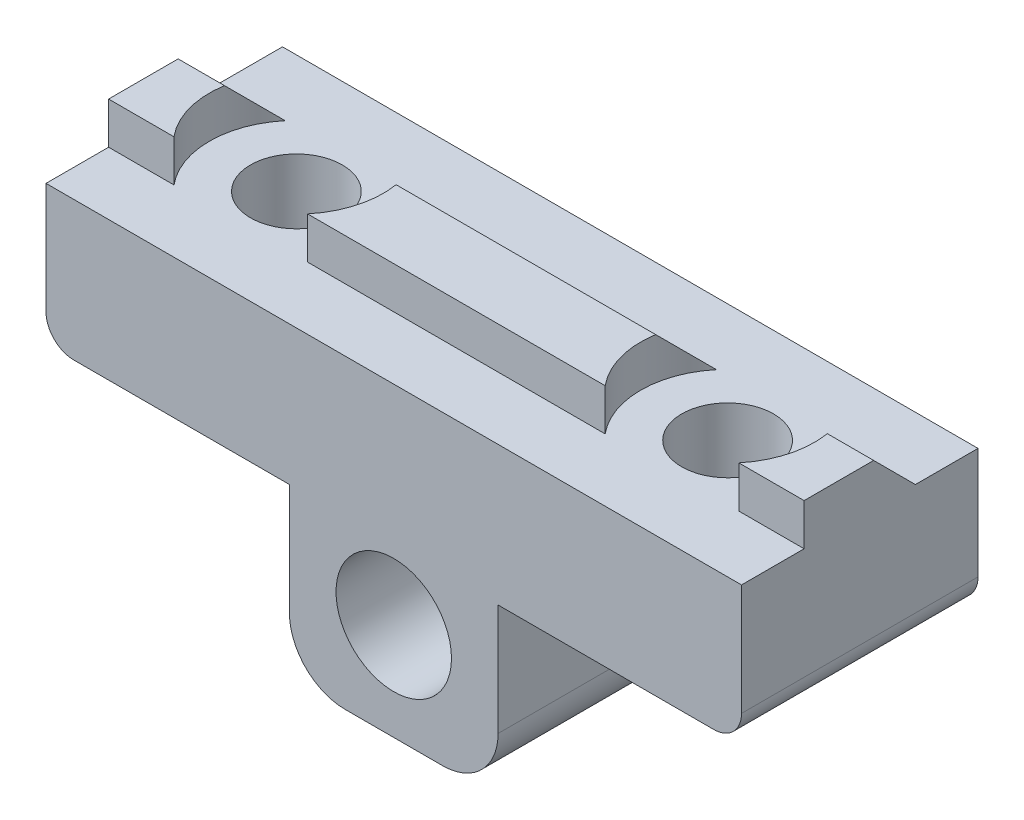
ISO-10303-21;
HEADER;
FILE_DESCRIPTION(('STEP AP214'),'2;1');
FILE_NAME('part.step','',(''),(''),'','','');
FILE_SCHEMA(('AUTOMOTIVE_DESIGN { 1 0 10303 214 1 1 1 1 }'));
ENDSEC;
DATA;
#1=APPLICATION_CONTEXT('core data for automotive mechanical design processes');
#2=APPLICATION_PROTOCOL_DEFINITION('international standard','automotive_design',2000,#1);
#3=PRODUCT_CONTEXT('',#1,'mechanical');
#4=PRODUCT('Part','Part','',(#3));
#5=PRODUCT_RELATED_PRODUCT_CATEGORY('part','',(#4));
#6=PRODUCT_DEFINITION_FORMATION('','',#4);
#7=PRODUCT_DEFINITION_CONTEXT('part definition',#1,'design');
#8=PRODUCT_DEFINITION('design','',#6,#7);
#9=PRODUCT_DEFINITION_SHAPE('','',#8);
#10=(LENGTH_UNIT() NAMED_UNIT(*) SI_UNIT(.MILLI.,.METRE.));
#11=(NAMED_UNIT(*) PLANE_ANGLE_UNIT() SI_UNIT($,.RADIAN.));
#12=(NAMED_UNIT(*) SI_UNIT($,.STERADIAN.) SOLID_ANGLE_UNIT());
#13=UNCERTAINTY_MEASURE_WITH_UNIT(LENGTH_MEASURE(1.E-05),#10,'distance_accuracy_value','');
#14=(GEOMETRIC_REPRESENTATION_CONTEXT(3) GLOBAL_UNCERTAINTY_ASSIGNED_CONTEXT((#13)) GLOBAL_UNIT_ASSIGNED_CONTEXT((#10,
#11,#12)) REPRESENTATION_CONTEXT('',''));
#15=CARTESIAN_POINT('',(0.,0.,0.));
#16=DIRECTION('',(0.,0.,1.));
#17=DIRECTION('',(1.,0.,0.));
#18=AXIS2_PLACEMENT_3D('',#15,#16,#17);
#19=CARTESIAN_POINT('',(0.,0.,17.));
#20=DIRECTION('',(0.,-1.,0.));
#21=DIRECTION('',(0.,0.,-1.));
#22=AXIS2_PLACEMENT_3D('',#19,#20,#21);
#23=PLANE('',#22);
#24=CARTESIAN_POINT('',(40.5,0.,8.5));
#25=DIRECTION('',(0.,-1.,0.));
#26=DIRECTION('',(0.,0.,-1.));
#27=AXIS2_PLACEMENT_3D('',#24,#25,#26);
#28=CIRCLE('',#27,3.3);
#29=CARTESIAN_POINT('',(40.5,0.,5.2));
#30=VERTEX_POINT('',#29);
#31=EDGE_CURVE('E294',#30,#30,#28,.T.);
#32=ORIENTED_EDGE('',*,*,#31,.T.);
#33=EDGE_LOOP('',(#32));
#34=FACE_BOUND('',#33,.T.);
#35=CARTESIAN_POINT('',(9.5,0.,8.5));
#36=DIRECTION('',(0.,-1.,0.));
#37=DIRECTION('',(0.,0.,-1.));
#38=AXIS2_PLACEMENT_3D('',#35,#36,#37);
#39=CIRCLE('',#38,3.3);
#40=CARTESIAN_POINT('',(9.5,0.,5.2));
#41=VERTEX_POINT('',#40);
#42=EDGE_CURVE('E282',#41,#41,#39,.T.);
#43=ORIENTED_EDGE('',*,*,#42,.T.);
#44=EDGE_LOOP('',(#43));
#45=FACE_BOUND('',#44,.T.);
#46=DIRECTION('',(-1.,0.,0.));
#47=VECTOR('',#46,1.);
#48=CARTESIAN_POINT('',(0.,0.,4.5));
#49=LINE('',#48,#47);
#50=CARTESIAN_POINT('',(35.6976568219254,0.,4.5));
#51=VERTEX_POINT('',#50);
#52=CARTESIAN_POINT('',(14.3023431780746,0.,4.5));
#53=VERTEX_POINT('',#52);
#54=EDGE_CURVE('E262',#51,#53,#49,.T.);
#55=ORIENTED_EDGE('',*,*,#54,.F.);
#56=CARTESIAN_POINT('',(40.5,0.,8.5));
#57=DIRECTION('',(0.,1.,0.));
#58=DIRECTION('',(0.,0.,1.));
#59=AXIS2_PLACEMENT_3D('',#56,#57,#58);
#60=CIRCLE('',#59,6.25000000000001);
#61=CARTESIAN_POINT('',(35.6976568219254,0.,12.5));
#62=VERTEX_POINT('',#61);
#63=EDGE_CURVE('E249',#51,#62,#60,.T.);
#64=ORIENTED_EDGE('',*,*,#63,.T.);
#65=DIRECTION('',(-1.,0.,0.));
#66=VECTOR('',#65,1.);
#67=CARTESIAN_POINT('',(0.,0.,12.5));
#68=LINE('',#67,#66);
#69=CARTESIAN_POINT('',(14.3023431780746,0.,12.5));
#70=VERTEX_POINT('',#69);
#71=EDGE_CURVE('E253',#62,#70,#68,.T.);
#72=ORIENTED_EDGE('',*,*,#71,.T.);
#73=CARTESIAN_POINT('',(9.5,0.,8.5));
#74=DIRECTION('',(0.,1.,0.));
#75=DIRECTION('',(0.,0.,1.));
#76=AXIS2_PLACEMENT_3D('',#73,#74,#75);
#77=CIRCLE('',#76,6.24999999999999);
#78=EDGE_CURVE('E264',#70,#53,#77,.T.);
#79=ORIENTED_EDGE('',*,*,#78,.T.);
#80=EDGE_LOOP('',(#55,#64,#72,#79));
#81=FACE_BOUND('',#80,.T.);
#82=DIRECTION('',(0.,0.,-1.));
#83=VECTOR('',#82,1.);
#84=CARTESIAN_POINT('',(50.,0.,17.));
#85=LINE('',#84,#83);
#86=CARTESIAN_POINT('',(50.,0.,17.));
#87=VERTEX_POINT('',#86);
#88=CARTESIAN_POINT('',(50.,0.,12.5));
#89=VERTEX_POINT('',#88);
#90=EDGE_CURVE('E362',#87,#89,#85,.T.);
#91=ORIENTED_EDGE('',*,*,#90,.T.);
#92=DIRECTION('',(-1.,0.,0.));
#93=VECTOR('',#92,1.);
#94=CARTESIAN_POINT('',(0.,0.,12.5));
#95=LINE('',#94,#93);
#96=CARTESIAN_POINT('',(45.3023431780747,0.,12.5));
#97=VERTEX_POINT('',#96);
#98=EDGE_CURVE('E225',#89,#97,#95,.T.);
#99=ORIENTED_EDGE('',*,*,#98,.T.);
#100=CARTESIAN_POINT('',(40.5,0.,8.5));
#101=DIRECTION('',(0.,1.,0.));
#102=DIRECTION('',(0.,0.,1.));
#103=AXIS2_PLACEMENT_3D('',#100,#101,#102);
#104=CIRCLE('',#103,6.25000000000001);
#105=CARTESIAN_POINT('',(45.3023431780747,0.,4.5));
#106=VERTEX_POINT('',#105);
#107=EDGE_CURVE('E200',#97,#106,#104,.T.);
#108=ORIENTED_EDGE('',*,*,#107,.T.);
#109=DIRECTION('',(-1.,0.,0.));
#110=VECTOR('',#109,1.);
#111=CARTESIAN_POINT('',(0.,0.,4.5));
#112=LINE('',#111,#110);
#113=CARTESIAN_POINT('',(50.,0.,4.5));
#114=VERTEX_POINT('',#113);
#115=EDGE_CURVE('E215',#114,#106,#112,.T.);
#116=ORIENTED_EDGE('',*,*,#115,.F.);
#117=CARTESIAN_POINT('',(50.,0.,0.));
#118=VERTEX_POINT('',#117);
#119=EDGE_CURVE('E361',#114,#118,#85,.T.);
#120=ORIENTED_EDGE('',*,*,#119,.T.);
#121=DIRECTION('',(-1.,0.,0.));
#122=VECTOR('',#121,1.);
#123=CARTESIAN_POINT('',(0.,0.,0.));
#124=LINE('',#123,#122);
#125=CARTESIAN_POINT('',(0.,0.,0.));
#126=VERTEX_POINT('',#125);
#127=EDGE_CURVE('E314',#118,#126,#124,.T.);
#128=ORIENTED_EDGE('',*,*,#127,.T.);
#129=DIRECTION('',(0.,0.,-1.));
#130=VECTOR('',#129,1.);
#131=CARTESIAN_POINT('',(0.,0.,17.));
#132=LINE('',#131,#130);
#133=CARTESIAN_POINT('',(0.,0.,4.5));
#134=VERTEX_POINT('',#133);
#135=EDGE_CURVE('E334',#134,#126,#132,.T.);
#136=ORIENTED_EDGE('',*,*,#135,.F.);
#137=DIRECTION('',(-1.,0.,0.));
#138=VECTOR('',#137,1.);
#139=CARTESIAN_POINT('',(0.,0.,4.5));
#140=LINE('',#139,#138);
#141=CARTESIAN_POINT('',(4.69765682192537,0.,4.5));
#142=VERTEX_POINT('',#141);
#143=EDGE_CURVE('E241',#142,#134,#140,.T.);
#144=ORIENTED_EDGE('',*,*,#143,.F.);
#145=CARTESIAN_POINT('',(9.5,0.,8.5));
#146=DIRECTION('',(0.,1.,0.));
#147=DIRECTION('',(0.,0.,1.));
#148=AXIS2_PLACEMENT_3D('',#145,#146,#147);
#149=CIRCLE('',#148,6.24999999999999);
#150=CARTESIAN_POINT('',(4.69765682192537,0.,12.5));
#151=VERTEX_POINT('',#150);
#152=EDGE_CURVE('E204',#142,#151,#149,.T.);
#153=ORIENTED_EDGE('',*,*,#152,.T.);
#154=DIRECTION('',(-1.,0.,0.));
#155=VECTOR('',#154,1.);
#156=CARTESIAN_POINT('',(0.,0.,12.5));
#157=LINE('',#156,#155);
#158=CARTESIAN_POINT('',(0.,0.,12.5));
#159=VERTEX_POINT('',#158);
#160=EDGE_CURVE('E233',#151,#159,#157,.T.);
#161=ORIENTED_EDGE('',*,*,#160,.T.);
#162=CARTESIAN_POINT('',(0.,0.,17.));
#163=VERTEX_POINT('',#162);
#164=EDGE_CURVE('E358',#163,#159,#132,.T.);
#165=ORIENTED_EDGE('',*,*,#164,.F.);
#166=DIRECTION('',(-1.,0.,0.));
#167=VECTOR('',#166,1.);
#168=CARTESIAN_POINT('',(0.,0.,17.));
#169=LINE('',#168,#167);
#170=EDGE_CURVE('E332',#87,#163,#169,.T.);
#171=ORIENTED_EDGE('',*,*,#170,.F.);
#172=EDGE_LOOP('',(#91,#99,#108,#116,#120,#128,#136,#144,#153,#161,#165,#171));
#173=FACE_BOUND('',#172,.T.);
#174=ADVANCED_FACE('F35',(#34,#45,#81,#173),#23,.F.);
#175=CARTESIAN_POINT('',(0.,-7.99999999999999,17.));
#176=DIRECTION('',(1.,0.,0.));
#177=DIRECTION('',(0.,0.,-1.));
#178=AXIS2_PLACEMENT_3D('',#175,#176,#177);
#179=PLANE('',#178);
#180=DIRECTION('',(0.,0.,1.));
#181=VECTOR('',#180,1.);
#182=CARTESIAN_POINT('',(0.,3.,0.));
#183=LINE('',#182,#181);
#184=CARTESIAN_POINT('',(0.,3.,7.5));
#185=VERTEX_POINT('',#184);
#186=CARTESIAN_POINT('',(0.,3.,12.5));
#187=VERTEX_POINT('',#186);
#188=EDGE_CURVE('E232',#185,#187,#183,.T.);
#189=ORIENTED_EDGE('',*,*,#188,.F.);
#190=DIRECTION('',(0.,-0.707106781186548,-0.707106781186547));
#191=VECTOR('',#190,1.);
#192=CARTESIAN_POINT('',(0.,3.,7.5));
#193=LINE('',#192,#191);
#194=EDGE_CURVE('E408',#185,#134,#193,.T.);
#195=ORIENTED_EDGE('',*,*,#194,.T.);
#196=ORIENTED_EDGE('',*,*,#135,.T.);
#197=DIRECTION('',(0.,-1.,0.));
#198=VECTOR('',#197,1.);
#199=CARTESIAN_POINT('',(0.,-7.99999999999999,0.));
#200=LINE('',#199,#198);
#201=CARTESIAN_POINT('',(0.,-7.99999999999999,0.));
#202=VERTEX_POINT('',#201);
#203=EDGE_CURVE('E309',#126,#202,#200,.T.);
#204=ORIENTED_EDGE('',*,*,#203,.T.);
#205=DIRECTION('',(0.,0.,-1.));
#206=VECTOR('',#205,1.);
#207=CARTESIAN_POINT('',(0.,-7.99999999999999,17.));
#208=LINE('',#207,#206);
#209=CARTESIAN_POINT('',(0.,-7.99999999999999,17.));
#210=VERTEX_POINT('',#209);
#211=EDGE_CURVE('E379',#210,#202,#208,.T.);
#212=ORIENTED_EDGE('',*,*,#211,.F.);
#213=DIRECTION('',(0.,-1.,0.));
#214=VECTOR('',#213,1.);
#215=CARTESIAN_POINT('',(0.,-7.99999999999999,17.));
#216=LINE('',#215,#214);
#217=EDGE_CURVE('E310',#163,#210,#216,.T.);
#218=ORIENTED_EDGE('',*,*,#217,.F.);
#219=ORIENTED_EDGE('',*,*,#164,.T.);
#220=DIRECTION('',(0.,-1.,0.));
#221=VECTOR('',#220,1.);
#222=CARTESIAN_POINT('',(0.,3.,12.5));
#223=LINE('',#222,#221);
#224=EDGE_CURVE('E247',#187,#159,#223,.T.);
#225=ORIENTED_EDGE('',*,*,#224,.F.);
#226=EDGE_LOOP('',(#189,#195,#196,#204,#212,#218,#219,#225));
#227=FACE_BOUND('',#226,.T.);
#228=ADVANCED_FACE('F437',(#227),#179,.F.);
#229=CARTESIAN_POINT('',(2.,-8.,17.));
#230=DIRECTION('',(0.,0.,-1.));
#231=DIRECTION('',(-1.,0.,0.));
#232=AXIS2_PLACEMENT_3D('',#229,#230,#231);
#233=CYLINDRICAL_SURFACE('',#232,2.);
#234=CARTESIAN_POINT('',(2.,-8.,0.));
#235=DIRECTION('',(0.,0.,1.));
#236=DIRECTION('',(1.,0.,0.));
#237=AXIS2_PLACEMENT_3D('',#234,#235,#236);
#238=CIRCLE('',#237,2.);
#239=CARTESIAN_POINT('',(2.00000000000001,-10.,0.));
#240=VERTEX_POINT('',#239);
#241=EDGE_CURVE('E337',#202,#240,#238,.T.);
#242=ORIENTED_EDGE('',*,*,#241,.T.);
#243=DIRECTION('',(0.,0.,-1.));
#244=VECTOR('',#243,1.);
#245=CARTESIAN_POINT('',(2.00000000000001,-10.,17.));
#246=LINE('',#245,#244);
#247=CARTESIAN_POINT('',(2.00000000000001,-10.,17.));
#248=VERTEX_POINT('',#247);
#249=EDGE_CURVE('E376',#248,#240,#246,.T.);
#250=ORIENTED_EDGE('',*,*,#249,.F.);
#251=CARTESIAN_POINT('',(2.,-8.,17.));
#252=DIRECTION('',(0.,0.,1.));
#253=DIRECTION('',(1.,0.,0.));
#254=AXIS2_PLACEMENT_3D('',#251,#252,#253);
#255=CIRCLE('',#254,2.);
#256=EDGE_CURVE('E313',#210,#248,#255,.T.);
#257=ORIENTED_EDGE('',*,*,#256,.F.);
#258=ORIENTED_EDGE('',*,*,#211,.T.);
#259=EDGE_LOOP('',(#242,#250,#257,#258));
#260=FACE_BOUND('',#259,.T.);
#261=ADVANCED_FACE('F443',(#260),#233,.T.);
#262=CARTESIAN_POINT('',(17.5,-10.,17.));
#263=DIRECTION('',(0.,1.,0.));
#264=DIRECTION('',(0.,0.,1.));
#265=AXIS2_PLACEMENT_3D('',#262,#263,#264);
#266=PLANE('',#265);
#267=CARTESIAN_POINT('',(9.5,-10.,8.5));
#268=DIRECTION('',(0.,-1.,0.));
#269=DIRECTION('',(0.,0.,-1.));
#270=AXIS2_PLACEMENT_3D('',#267,#268,#269);
#271=CIRCLE('',#270,6.);
#272=CARTESIAN_POINT('',(9.5,-10.,2.5));
#273=VERTEX_POINT('',#272);
#274=EDGE_CURVE('E273',#273,#273,#271,.T.);
#275=ORIENTED_EDGE('',*,*,#274,.F.);
#276=EDGE_LOOP('',(#275));
#277=FACE_BOUND('',#276,.T.);
#278=DIRECTION('',(1.,0.,0.));
#279=VECTOR('',#278,1.);
#280=CARTESIAN_POINT('',(17.5,-10.,0.));
#281=LINE('',#280,#279);
#282=CARTESIAN_POINT('',(17.5,-10.,0.));
#283=VERTEX_POINT('',#282);
#284=EDGE_CURVE('E339',#240,#283,#281,.T.);
#285=ORIENTED_EDGE('',*,*,#284,.T.);
#286=DIRECTION('',(0.,0.,-1.));
#287=VECTOR('',#286,1.);
#288=CARTESIAN_POINT('',(17.5,-10.,17.));
#289=LINE('',#288,#287);
#290=CARTESIAN_POINT('',(17.5,-10.,17.));
#291=VERTEX_POINT('',#290);
#292=EDGE_CURVE('E373',#291,#283,#289,.T.);
#293=ORIENTED_EDGE('',*,*,#292,.F.);
#294=DIRECTION('',(1.,0.,0.));
#295=VECTOR('',#294,1.);
#296=CARTESIAN_POINT('',(17.5,-10.,17.));
#297=LINE('',#296,#295);
#298=EDGE_CURVE('E316',#248,#291,#297,.T.);
#299=ORIENTED_EDGE('',*,*,#298,.F.);
#300=ORIENTED_EDGE('',*,*,#249,.T.);
#301=EDGE_LOOP('',(#285,#293,#299,#300));
#302=FACE_BOUND('',#301,.T.);
#303=ADVANCED_FACE('F475',(#277,#302),#266,.F.);
#304=CARTESIAN_POINT('',(17.5,-22.,17.));
#305=DIRECTION('',(1.,0.,0.));
#306=DIRECTION('',(0.,0.,-1.));
#307=AXIS2_PLACEMENT_3D('',#304,#305,#306);
#308=PLANE('',#307);
#309=DIRECTION('',(0.,-1.,0.));
#310=VECTOR('',#309,1.);
#311=CARTESIAN_POINT('',(17.5,-22.,0.));
#312=LINE('',#311,#310);
#313=CARTESIAN_POINT('',(17.5,-18.,0.));
#314=VERTEX_POINT('',#313);
#315=EDGE_CURVE('E341',#283,#314,#312,.T.);
#316=ORIENTED_EDGE('',*,*,#315,.T.);
#317=DIRECTION('',(0.,0.,-1.));
#318=VECTOR('',#317,1.);
#319=CARTESIAN_POINT('',(17.5,-18.,17.));
#320=LINE('',#319,#318);
#321=CARTESIAN_POINT('',(17.5,-18.,17.));
#322=VERTEX_POINT('',#321);
#323=EDGE_CURVE('E391',#314,#322,#320,.F.);
#324=ORIENTED_EDGE('',*,*,#323,.T.);
#325=DIRECTION('',(0.,-1.,0.));
#326=VECTOR('',#325,1.);
#327=CARTESIAN_POINT('',(17.5,-22.,17.));
#328=LINE('',#327,#326);
#329=EDGE_CURVE('E318',#291,#322,#328,.T.);
#330=ORIENTED_EDGE('',*,*,#329,.F.);
#331=ORIENTED_EDGE('',*,*,#292,.T.);
#332=EDGE_LOOP('',(#316,#324,#330,#331));
#333=FACE_BOUND('',#332,.T.);
#334=ADVANCED_FACE('F471',(#333),#308,.F.);
#335=CARTESIAN_POINT('',(32.5,-22.,17.));
#336=DIRECTION('',(0.,1.,0.));
#337=DIRECTION('',(0.,0.,1.));
#338=AXIS2_PLACEMENT_3D('',#335,#336,#337);
#339=PLANE('',#338);
#340=DIRECTION('',(1.,0.,0.));
#341=VECTOR('',#340,1.);
#342=CARTESIAN_POINT('',(32.5,-22.,17.));
#343=LINE('',#342,#341);
#344=CARTESIAN_POINT('',(21.5,-22.,17.));
#345=VERTEX_POINT('',#344);
#346=CARTESIAN_POINT('',(28.5,-22.,17.));
#347=VERTEX_POINT('',#346);
#348=EDGE_CURVE('E321',#345,#347,#343,.T.);
#349=ORIENTED_EDGE('',*,*,#348,.F.);
#350=DIRECTION('',(0.,0.,-1.));
#351=VECTOR('',#350,1.);
#352=CARTESIAN_POINT('',(21.5,-22.,17.));
#353=LINE('',#352,#351);
#354=CARTESIAN_POINT('',(21.5,-22.,0.));
#355=VERTEX_POINT('',#354);
#356=EDGE_CURVE('E384',#345,#355,#353,.T.);
#357=ORIENTED_EDGE('',*,*,#356,.T.);
#358=DIRECTION('',(1.,0.,0.));
#359=VECTOR('',#358,1.);
#360=CARTESIAN_POINT('',(32.5,-22.,0.));
#361=LINE('',#360,#359);
#362=CARTESIAN_POINT('',(28.5,-22.,0.));
#363=VERTEX_POINT('',#362);
#364=EDGE_CURVE('E344',#355,#363,#361,.T.);
#365=ORIENTED_EDGE('',*,*,#364,.T.);
#366=DIRECTION('',(0.,0.,-1.));
#367=VECTOR('',#366,1.);
#368=CARTESIAN_POINT('',(28.5,-22.,17.));
#369=LINE('',#368,#367);
#370=EDGE_CURVE('E382',#363,#347,#369,.F.);
#371=ORIENTED_EDGE('',*,*,#370,.T.);
#372=EDGE_LOOP('',(#349,#357,#365,#371));
#373=FACE_BOUND('',#372,.T.);
#374=ADVANCED_FACE('F467',(#373),#339,.F.);
#375=CARTESIAN_POINT('',(32.5,-22.,17.));
#376=DIRECTION('',(-1.,0.,0.));
#377=DIRECTION('',(0.,0.,1.));
#378=AXIS2_PLACEMENT_3D('',#375,#376,#377);
#379=PLANE('',#378);
#380=DIRECTION('',(0.,1.,0.));
#381=VECTOR('',#380,1.);
#382=CARTESIAN_POINT('',(32.5,-22.,17.));
#383=LINE('',#382,#381);
#384=CARTESIAN_POINT('',(32.5,-18.,17.));
#385=VERTEX_POINT('',#384);
#386=CARTESIAN_POINT('',(32.5,-10.,17.));
#387=VERTEX_POINT('',#386);
#388=EDGE_CURVE('E324',#385,#387,#383,.T.);
#389=ORIENTED_EDGE('',*,*,#388,.F.);
#390=DIRECTION('',(0.,0.,-1.));
#391=VECTOR('',#390,1.);
#392=CARTESIAN_POINT('',(32.5,-18.,17.));
#393=LINE('',#392,#391);
#394=CARTESIAN_POINT('',(32.5,-18.,0.));
#395=VERTEX_POINT('',#394);
#396=EDGE_CURVE('E397',#385,#395,#393,.T.);
#397=ORIENTED_EDGE('',*,*,#396,.T.);
#398=DIRECTION('',(0.,1.,0.));
#399=VECTOR('',#398,1.);
#400=CARTESIAN_POINT('',(32.5,-22.,0.));
#401=LINE('',#400,#399);
#402=CARTESIAN_POINT('',(32.5,-10.,0.));
#403=VERTEX_POINT('',#402);
#404=EDGE_CURVE('E347',#395,#403,#401,.T.);
#405=ORIENTED_EDGE('',*,*,#404,.T.);
#406=DIRECTION('',(0.,0.,-1.));
#407=VECTOR('',#406,1.);
#408=CARTESIAN_POINT('',(32.5,-10.,17.));
#409=LINE('',#408,#407);
#410=EDGE_CURVE('E370',#387,#403,#409,.T.);
#411=ORIENTED_EDGE('',*,*,#410,.F.);
#412=EDGE_LOOP('',(#389,#397,#405,#411));
#413=FACE_BOUND('',#412,.T.);
#414=ADVANCED_FACE('F463',(#413),#379,.F.);
#415=CARTESIAN_POINT('',(32.5,-10.,17.));
#416=DIRECTION('',(0.,1.,0.));
#417=DIRECTION('',(0.,0.,1.));
#418=AXIS2_PLACEMENT_3D('',#415,#416,#417);
#419=PLANE('',#418);
#420=CARTESIAN_POINT('',(40.5,-9.99999999999999,8.5));
#421=DIRECTION('',(0.,-1.,0.));
#422=DIRECTION('',(0.,0.,-1.));
#423=AXIS2_PLACEMENT_3D('',#420,#421,#422);
#424=CIRCLE('',#423,6.);
#425=CARTESIAN_POINT('',(40.5,-9.99999999999999,2.5));
#426=VERTEX_POINT('',#425);
#427=EDGE_CURVE('E285',#426,#426,#424,.T.);
#428=ORIENTED_EDGE('',*,*,#427,.F.);
#429=EDGE_LOOP('',(#428));
#430=FACE_BOUND('',#429,.T.);
#431=DIRECTION('',(1.,0.,0.));
#432=VECTOR('',#431,1.);
#433=CARTESIAN_POINT('',(32.5,-10.,0.));
#434=LINE('',#433,#432);
#435=CARTESIAN_POINT('',(48.,-10.,0.));
#436=VERTEX_POINT('',#435);
#437=EDGE_CURVE('E349',#403,#436,#434,.T.);
#438=ORIENTED_EDGE('',*,*,#437,.T.);
#439=DIRECTION('',(0.,0.,-1.));
#440=VECTOR('',#439,1.);
#441=CARTESIAN_POINT('',(48.,-10.,17.));
#442=LINE('',#441,#440);
#443=CARTESIAN_POINT('',(48.,-10.,17.));
#444=VERTEX_POINT('',#443);
#445=EDGE_CURVE('E367',#444,#436,#442,.T.);
#446=ORIENTED_EDGE('',*,*,#445,.F.);
#447=DIRECTION('',(1.,0.,0.));
#448=VECTOR('',#447,1.);
#449=CARTESIAN_POINT('',(32.5,-10.,17.));
#450=LINE('',#449,#448);
#451=EDGE_CURVE('E326',#387,#444,#450,.T.);
#452=ORIENTED_EDGE('',*,*,#451,.F.);
#453=ORIENTED_EDGE('',*,*,#410,.T.);
#454=EDGE_LOOP('',(#438,#446,#452,#453));
#455=FACE_BOUND('',#454,.T.);
#456=ADVANCED_FACE('F459',(#430,#455),#419,.F.);
#457=CARTESIAN_POINT('',(48.,-8.,17.));
#458=DIRECTION('',(0.,0.,-1.));
#459=DIRECTION('',(-1.,0.,0.));
#460=AXIS2_PLACEMENT_3D('',#457,#458,#459);
#461=CYLINDRICAL_SURFACE('',#460,2.);
#462=CARTESIAN_POINT('',(48.,-8.,0.));
#463=DIRECTION('',(0.,0.,1.));
#464=DIRECTION('',(-1.,0.,0.));
#465=AXIS2_PLACEMENT_3D('',#462,#463,#464);
#466=CIRCLE('',#465,2.);
#467=CARTESIAN_POINT('',(50.,-8.,0.));
#468=VERTEX_POINT('',#467);
#469=EDGE_CURVE('E351',#436,#468,#466,.T.);
#470=ORIENTED_EDGE('',*,*,#469,.T.);
#471=DIRECTION('',(0.,0.,-1.));
#472=VECTOR('',#471,1.);
#473=CARTESIAN_POINT('',(50.,-8.,17.));
#474=LINE('',#473,#472);
#475=CARTESIAN_POINT('',(50.,-8.,17.));
#476=VERTEX_POINT('',#475);
#477=EDGE_CURVE('E364',#476,#468,#474,.T.);
#478=ORIENTED_EDGE('',*,*,#477,.F.);
#479=CARTESIAN_POINT('',(48.,-8.,17.));
#480=DIRECTION('',(0.,0.,1.));
#481=DIRECTION('',(-1.,0.,0.));
#482=AXIS2_PLACEMENT_3D('',#479,#480,#481);
#483=CIRCLE('',#482,2.);
#484=EDGE_CURVE('E328',#444,#476,#483,.T.);
#485=ORIENTED_EDGE('',*,*,#484,.F.);
#486=ORIENTED_EDGE('',*,*,#445,.T.);
#487=EDGE_LOOP('',(#470,#478,#485,#486));
#488=FACE_BOUND('',#487,.T.);
#489=ADVANCED_FACE('F455',(#488),#461,.T.);
#490=CARTESIAN_POINT('',(50.,0.,17.));
#491=DIRECTION('',(-1.,0.,0.));
#492=DIRECTION('',(0.,0.,1.));
#493=AXIS2_PLACEMENT_3D('',#490,#491,#492);
#494=PLANE('',#493);
#495=ORIENTED_EDGE('',*,*,#119,.F.);
#496=DIRECTION('',(0.,0.707106781186548,0.707106781186547));
#497=VECTOR('',#496,1.);
#498=CARTESIAN_POINT('',(50.,3.,7.50000000000001));
#499=LINE('',#498,#497);
#500=CARTESIAN_POINT('',(50.,3.,7.50000000000002));
#501=VERTEX_POINT('',#500);
#502=EDGE_CURVE('E403',#114,#501,#499,.T.);
#503=ORIENTED_EDGE('',*,*,#502,.T.);
#504=DIRECTION('',(0.,0.,-1.));
#505=VECTOR('',#504,1.);
#506=CARTESIAN_POINT('',(50.,3.,0.));
#507=LINE('',#506,#505);
#508=CARTESIAN_POINT('',(50.,3.,12.5));
#509=VERTEX_POINT('',#508);
#510=EDGE_CURVE('E220',#509,#501,#507,.T.);
#511=ORIENTED_EDGE('',*,*,#510,.F.);
#512=DIRECTION('',(0.,-1.,0.));
#513=VECTOR('',#512,1.);
#514=CARTESIAN_POINT('',(50.,3.,12.5));
#515=LINE('',#514,#513);
#516=EDGE_CURVE('E205',#509,#89,#515,.T.);
#517=ORIENTED_EDGE('',*,*,#516,.T.);
#518=ORIENTED_EDGE('',*,*,#90,.F.);
#519=DIRECTION('',(0.,1.,0.));
#520=VECTOR('',#519,1.);
#521=CARTESIAN_POINT('',(50.,0.,17.));
#522=LINE('',#521,#520);
#523=EDGE_CURVE('E330',#476,#87,#522,.T.);
#524=ORIENTED_EDGE('',*,*,#523,.F.);
#525=ORIENTED_EDGE('',*,*,#477,.T.);
#526=DIRECTION('',(0.,1.,0.));
#527=VECTOR('',#526,1.);
#528=CARTESIAN_POINT('',(50.,0.,0.));
#529=LINE('',#528,#527);
#530=EDGE_CURVE('E353',#468,#118,#529,.T.);
#531=ORIENTED_EDGE('',*,*,#530,.T.);
#532=EDGE_LOOP('',(#495,#503,#511,#517,#518,#524,#525,#531));
#533=FACE_BOUND('',#532,.T.);
#534=ADVANCED_FACE('F451',(#533),#494,.F.);
#535=CARTESIAN_POINT('',(48.,-8.,17.));
#536=DIRECTION('',(0.,0.,-1.));
#537=DIRECTION('',(-1.,0.,0.));
#538=AXIS2_PLACEMENT_3D('',#535,#536,#537);
#539=PLANE('',#538);
#540=CARTESIAN_POINT('',(25.,-15.,17.));
#541=DIRECTION('',(0.,0.,1.));
#542=DIRECTION('',(1.,0.,0.));
#543=AXIS2_PLACEMENT_3D('',#540,#541,#542);
#544=CIRCLE('',#543,4.15);
#545=CARTESIAN_POINT('',(29.15,-15.,17.));
#546=VERTEX_POINT('',#545);
#547=EDGE_CURVE('E297',#546,#546,#544,.T.);
#548=ORIENTED_EDGE('',*,*,#547,.F.);
#549=EDGE_LOOP('',(#548));
#550=FACE_BOUND('',#549,.T.);
#551=ORIENTED_EDGE('',*,*,#329,.T.);
#552=CARTESIAN_POINT('',(21.5,-18.,17.));
#553=DIRECTION('',(0.,0.,-1.));
#554=DIRECTION('',(-1.,0.,0.));
#555=AXIS2_PLACEMENT_3D('',#552,#553,#554);
#556=CIRCLE('',#555,4.);
#557=EDGE_CURVE('E395',#322,#345,#556,.F.);
#558=ORIENTED_EDGE('',*,*,#557,.T.);
#559=ORIENTED_EDGE('',*,*,#348,.T.);
#560=CARTESIAN_POINT('',(28.5,-18.,17.));
#561=DIRECTION('',(0.,0.,-1.));
#562=DIRECTION('',(-1.,0.,0.));
#563=AXIS2_PLACEMENT_3D('',#560,#561,#562);
#564=CIRCLE('',#563,4.);
#565=EDGE_CURVE('E393',#347,#385,#564,.F.);
#566=ORIENTED_EDGE('',*,*,#565,.T.);
#567=ORIENTED_EDGE('',*,*,#388,.T.);
#568=ORIENTED_EDGE('',*,*,#451,.T.);
#569=ORIENTED_EDGE('',*,*,#484,.T.);
#570=ORIENTED_EDGE('',*,*,#523,.T.);
#571=ORIENTED_EDGE('',*,*,#170,.T.);
#572=ORIENTED_EDGE('',*,*,#217,.T.);
#573=ORIENTED_EDGE('',*,*,#256,.T.);
#574=ORIENTED_EDGE('',*,*,#298,.T.);
#575=EDGE_LOOP('',(#551,#558,#559,#566,#567,#568,#569,#570,#571,#572,#573,#574));
#576=FACE_BOUND('',#575,.T.);
#577=ADVANCED_FACE('F454',(#550,#576),#539,.F.);
#578=CARTESIAN_POINT('',(48.,-8.,0.));
#579=DIRECTION('',(0.,0.,-1.));
#580=DIRECTION('',(-1.,0.,0.));
#581=AXIS2_PLACEMENT_3D('',#578,#579,#580);
#582=PLANE('',#581);
#583=CARTESIAN_POINT('',(25.,-15.,0.));
#584=DIRECTION('',(0.,0.,1.));
#585=DIRECTION('',(1.,0.,0.));
#586=AXIS2_PLACEMENT_3D('',#583,#584,#585);
#587=CIRCLE('',#586,3.3);
#588=CARTESIAN_POINT('',(28.3,-15.,0.));
#589=VERTEX_POINT('',#588);
#590=EDGE_CURVE('E306',#589,#589,#587,.T.);
#591=ORIENTED_EDGE('',*,*,#590,.T.);
#592=EDGE_LOOP('',(#591));
#593=FACE_BOUND('',#592,.T.);
#594=ORIENTED_EDGE('',*,*,#364,.F.);
#595=CARTESIAN_POINT('',(21.5,-18.,0.));
#596=DIRECTION('',(0.,0.,-1.));
#597=DIRECTION('',(-1.,0.,0.));
#598=AXIS2_PLACEMENT_3D('',#595,#596,#597);
#599=CIRCLE('',#598,4.);
#600=EDGE_CURVE('E389',#355,#314,#599,.T.);
#601=ORIENTED_EDGE('',*,*,#600,.T.);
#602=ORIENTED_EDGE('',*,*,#315,.F.);
#603=ORIENTED_EDGE('',*,*,#284,.F.);
#604=ORIENTED_EDGE('',*,*,#241,.F.);
#605=ORIENTED_EDGE('',*,*,#203,.F.);
#606=ORIENTED_EDGE('',*,*,#127,.F.);
#607=ORIENTED_EDGE('',*,*,#530,.F.);
#608=ORIENTED_EDGE('',*,*,#469,.F.);
#609=ORIENTED_EDGE('',*,*,#437,.F.);
#610=ORIENTED_EDGE('',*,*,#404,.F.);
#611=CARTESIAN_POINT('',(28.5,-18.,0.));
#612=DIRECTION('',(0.,0.,-1.));
#613=DIRECTION('',(-1.,0.,0.));
#614=AXIS2_PLACEMENT_3D('',#611,#612,#613);
#615=CIRCLE('',#614,4.);
#616=EDGE_CURVE('E387',#395,#363,#615,.T.);
#617=ORIENTED_EDGE('',*,*,#616,.T.);
#618=EDGE_LOOP('',(#594,#601,#602,#603,#604,#605,#606,#607,#608,#609,#610,#617));
#619=FACE_BOUND('',#618,.T.);
#620=ADVANCED_FACE('F449',(#593,#619),#582,.T.);
#621=CARTESIAN_POINT('',(25.,-15.,17.));
#622=DIRECTION('',(0.,0.,1.));
#623=DIRECTION('',(1.,0.,0.));
#624=AXIS2_PLACEMENT_3D('',#621,#622,#623);
#625=CYLINDRICAL_SURFACE('',#624,3.3);
#626=ORIENTED_EDGE('',*,*,#590,.F.);
#627=EDGE_LOOP('',(#626));
#628=FACE_BOUND('',#627,.T.);
#629=CARTESIAN_POINT('',(25.,-15.,7.));
#630=DIRECTION('',(0.,0.,1.));
#631=DIRECTION('',(1.,0.,0.));
#632=AXIS2_PLACEMENT_3D('',#629,#630,#631);
#633=CIRCLE('',#632,3.3);
#634=CARTESIAN_POINT('',(28.3,-15.,7.));
#635=VERTEX_POINT('',#634);
#636=EDGE_CURVE('E303',#635,#635,#633,.T.);
#637=ORIENTED_EDGE('',*,*,#636,.T.);
#638=EDGE_LOOP('',(#637));
#639=FACE_BOUND('',#638,.T.);
#640=ADVANCED_FACE('F555',(#628,#639),#625,.F.);
#641=CARTESIAN_POINT('',(28.3,-15.,7.));
#642=DIRECTION('',(0.,0.,-1.));
#643=DIRECTION('',(-1.,0.,0.));
#644=AXIS2_PLACEMENT_3D('',#641,#642,#643);
#645=PLANE('',#644);
#646=ORIENTED_EDGE('',*,*,#636,.F.);
#647=EDGE_LOOP('',(#646));
#648=FACE_BOUND('',#647,.T.);
#649=CARTESIAN_POINT('',(25.,-15.,7.));
#650=DIRECTION('',(0.,0.,1.));
#651=DIRECTION('',(1.,0.,0.));
#652=AXIS2_PLACEMENT_3D('',#649,#650,#651);
#653=CIRCLE('',#652,4.15);
#654=CARTESIAN_POINT('',(29.15,-15.,7.));
#655=VERTEX_POINT('',#654);
#656=EDGE_CURVE('E300',#655,#655,#653,.T.);
#657=ORIENTED_EDGE('',*,*,#656,.T.);
#658=EDGE_LOOP('',(#657));
#659=FACE_BOUND('',#658,.T.);
#660=ADVANCED_FACE('F561',(#648,#659),#645,.F.);
#661=CARTESIAN_POINT('',(25.,-15.,17.));
#662=DIRECTION('',(0.,0.,1.));
#663=DIRECTION('',(1.,0.,0.));
#664=AXIS2_PLACEMENT_3D('',#661,#662,#663);
#665=CYLINDRICAL_SURFACE('',#664,4.15);
#666=ORIENTED_EDGE('',*,*,#656,.F.);
#667=EDGE_LOOP('',(#666));
#668=FACE_BOUND('',#667,.T.);
#669=ORIENTED_EDGE('',*,*,#547,.T.);
#670=EDGE_LOOP('',(#669));
#671=FACE_BOUND('',#670,.T.);
#672=ADVANCED_FACE('F571',(#668,#671),#665,.F.);
#673=CARTESIAN_POINT('',(40.5,-9.99999999999999,8.5));
#674=DIRECTION('',(0.,-1.,0.));
#675=DIRECTION('',(0.,0.,-1.));
#676=AXIS2_PLACEMENT_3D('',#673,#674,#675);
#677=CYLINDRICAL_SURFACE('',#676,3.3);
#678=ORIENTED_EDGE('',*,*,#31,.F.);
#679=EDGE_LOOP('',(#678));
#680=FACE_BOUND('',#679,.T.);
#681=CARTESIAN_POINT('',(40.5,-7.99999999999999,8.5));
#682=DIRECTION('',(0.,-1.,0.));
#683=DIRECTION('',(0.,0.,-1.));
#684=AXIS2_PLACEMENT_3D('',#681,#682,#683);
#685=CIRCLE('',#684,3.3);
#686=CARTESIAN_POINT('',(40.5,-7.99999999999999,5.2));
#687=VERTEX_POINT('',#686);
#688=EDGE_CURVE('E291',#687,#687,#685,.T.);
#689=ORIENTED_EDGE('',*,*,#688,.T.);
#690=EDGE_LOOP('',(#689));
#691=FACE_BOUND('',#690,.T.);
#692=ADVANCED_FACE('F577',(#680,#691),#677,.F.);
#693=CARTESIAN_POINT('',(43.8,-7.99999999999999,8.5));
#694=DIRECTION('',(0.,1.,0.));
#695=DIRECTION('',(0.,0.,1.));
#696=AXIS2_PLACEMENT_3D('',#693,#694,#695);
#697=PLANE('',#696);
#698=ORIENTED_EDGE('',*,*,#688,.F.);
#699=EDGE_LOOP('',(#698));
#700=FACE_BOUND('',#699,.T.);
#701=CARTESIAN_POINT('',(40.5,-7.99999999999999,8.5));
#702=DIRECTION('',(0.,-1.,0.));
#703=DIRECTION('',(0.,0.,-1.));
#704=AXIS2_PLACEMENT_3D('',#701,#702,#703);
#705=CIRCLE('',#704,6.);
#706=CARTESIAN_POINT('',(40.5,-7.99999999999999,2.5));
#707=VERTEX_POINT('',#706);
#708=EDGE_CURVE('E288',#707,#707,#705,.T.);
#709=ORIENTED_EDGE('',*,*,#708,.T.);
#710=EDGE_LOOP('',(#709));
#711=FACE_BOUND('',#710,.T.);
#712=ADVANCED_FACE('F583',(#700,#711),#697,.F.);
#713=CARTESIAN_POINT('',(40.5,-9.99999999999999,8.5));
#714=DIRECTION('',(0.,-1.,0.));
#715=DIRECTION('',(0.,0.,-1.));
#716=AXIS2_PLACEMENT_3D('',#713,#714,#715);
#717=CYLINDRICAL_SURFACE('',#716,6.);
#718=ORIENTED_EDGE('',*,*,#708,.F.);
#719=EDGE_LOOP('',(#718));
#720=FACE_BOUND('',#719,.T.);
#721=ORIENTED_EDGE('',*,*,#427,.T.);
#722=EDGE_LOOP('',(#721));
#723=FACE_BOUND('',#722,.T.);
#724=ADVANCED_FACE('F589',(#720,#723),#717,.F.);
#725=CARTESIAN_POINT('',(9.5,-10.,8.5));
#726=DIRECTION('',(0.,-1.,0.));
#727=DIRECTION('',(0.,0.,-1.));
#728=AXIS2_PLACEMENT_3D('',#725,#726,#727);
#729=CYLINDRICAL_SURFACE('',#728,3.3);
#730=ORIENTED_EDGE('',*,*,#42,.F.);
#731=EDGE_LOOP('',(#730));
#732=FACE_BOUND('',#731,.T.);
#733=CARTESIAN_POINT('',(9.5,-8.,8.5));
#734=DIRECTION('',(0.,-1.,0.));
#735=DIRECTION('',(0.,0.,-1.));
#736=AXIS2_PLACEMENT_3D('',#733,#734,#735);
#737=CIRCLE('',#736,3.3);
#738=CARTESIAN_POINT('',(9.5,-8.,5.2));
#739=VERTEX_POINT('',#738);
#740=EDGE_CURVE('E279',#739,#739,#737,.T.);
#741=ORIENTED_EDGE('',*,*,#740,.T.);
#742=EDGE_LOOP('',(#741));
#743=FACE_BOUND('',#742,.T.);
#744=ADVANCED_FACE('F593',(#732,#743),#729,.F.);
#745=CARTESIAN_POINT('',(12.8,-8.,8.5));
#746=DIRECTION('',(0.,1.,0.));
#747=DIRECTION('',(0.,0.,1.));
#748=AXIS2_PLACEMENT_3D('',#745,#746,#747);
#749=PLANE('',#748);
#750=ORIENTED_EDGE('',*,*,#740,.F.);
#751=EDGE_LOOP('',(#750));
#752=FACE_BOUND('',#751,.T.);
#753=CARTESIAN_POINT('',(9.5,-8.,8.5));
#754=DIRECTION('',(0.,-1.,0.));
#755=DIRECTION('',(0.,0.,-1.));
#756=AXIS2_PLACEMENT_3D('',#753,#754,#755);
#757=CIRCLE('',#756,6.);
#758=CARTESIAN_POINT('',(9.5,-8.,2.5));
#759=VERTEX_POINT('',#758);
#760=EDGE_CURVE('E276',#759,#759,#757,.T.);
#761=ORIENTED_EDGE('',*,*,#760,.T.);
#762=EDGE_LOOP('',(#761));
#763=FACE_BOUND('',#762,.T.);
#764=ADVANCED_FACE('F597',(#752,#763),#749,.F.);
#765=CARTESIAN_POINT('',(9.5,-10.,8.5));
#766=DIRECTION('',(0.,-1.,0.));
#767=DIRECTION('',(0.,0.,-1.));
#768=AXIS2_PLACEMENT_3D('',#765,#766,#767);
#769=CYLINDRICAL_SURFACE('',#768,6.);
#770=ORIENTED_EDGE('',*,*,#760,.F.);
#771=EDGE_LOOP('',(#770));
#772=FACE_BOUND('',#771,.T.);
#773=ORIENTED_EDGE('',*,*,#274,.T.);
#774=EDGE_LOOP('',(#773));
#775=FACE_BOUND('',#774,.T.);
#776=ADVANCED_FACE('F487',(#772,#775),#769,.F.);
#777=CARTESIAN_POINT('',(21.5,-18.,17.));
#778=DIRECTION('',(0.,0.,-1.));
#779=DIRECTION('',(-1.,0.,0.));
#780=AXIS2_PLACEMENT_3D('',#777,#778,#779);
#781=CYLINDRICAL_SURFACE('',#780,4.);
#782=ORIENTED_EDGE('',*,*,#557,.F.);
#783=ORIENTED_EDGE('',*,*,#323,.F.);
#784=ORIENTED_EDGE('',*,*,#600,.F.);
#785=ORIENTED_EDGE('',*,*,#356,.F.);
#786=EDGE_LOOP('',(#782,#783,#784,#785));
#787=FACE_BOUND('',#786,.T.);
#788=ADVANCED_FACE('F483',(#787),#781,.T.);
#789=CARTESIAN_POINT('',(28.5,-18.,17.));
#790=DIRECTION('',(0.,0.,-1.));
#791=DIRECTION('',(-1.,0.,0.));
#792=AXIS2_PLACEMENT_3D('',#789,#790,#791);
#793=CYLINDRICAL_SURFACE('',#792,4.);
#794=ORIENTED_EDGE('',*,*,#565,.F.);
#795=ORIENTED_EDGE('',*,*,#370,.F.);
#796=ORIENTED_EDGE('',*,*,#616,.F.);
#797=ORIENTED_EDGE('',*,*,#396,.F.);
#798=EDGE_LOOP('',(#794,#795,#796,#797));
#799=FACE_BOUND('',#798,.T.);
#800=ADVANCED_FACE('F486',(#799),#793,.T.);
#801=CARTESIAN_POINT('',(40.5,3.,8.5));
#802=DIRECTION('',(0.,-1.,0.));
#803=DIRECTION('',(0.,0.,-1.));
#804=AXIS2_PLACEMENT_3D('',#801,#802,#803);
#805=CYLINDRICAL_SURFACE('',#804,6.25000000000001);
#806=ORIENTED_EDGE('',*,*,#63,.F.);
#807=CARTESIAN_POINT('',(40.5,3.99999999999999,8.5));
#808=DIRECTION('',(0.,0.707106781186544,-0.707106781186551));
#809=DIRECTION('',(0.,-0.707106781186551,-0.707106781186544));
#810=AXIS2_PLACEMENT_3D('',#807,#808,#809);
#811=ELLIPSE('',#810,8.8388347648319,6.25000000000001);
#812=CARTESIAN_POINT('',(34.3305186603735,3.,7.50000000000003));
#813=VERTEX_POINT('',#812);
#814=EDGE_CURVE('E11',#51,#813,#811,.T.);
#815=ORIENTED_EDGE('',*,*,#814,.T.);
#816=CARTESIAN_POINT('',(40.5,3.,8.5));
#817=DIRECTION('',(0.,1.,0.));
#818=DIRECTION('',(0.,0.,1.));
#819=AXIS2_PLACEMENT_3D('',#816,#817,#818);
#820=CIRCLE('',#819,6.25000000000001);
#821=CARTESIAN_POINT('',(35.6976568219254,3.,12.5));
#822=VERTEX_POINT('',#821);
#823=EDGE_CURVE('E250',#813,#822,#820,.T.);
#824=ORIENTED_EDGE('',*,*,#823,.T.);
#825=DIRECTION('',(0.,-1.,0.));
#826=VECTOR('',#825,1.);
#827=CARTESIAN_POINT('',(35.6976568219254,3.,12.5));
#828=LINE('',#827,#826);
#829=EDGE_CURVE('E259',#822,#62,#828,.T.);
#830=ORIENTED_EDGE('',*,*,#829,.T.);
#831=EDGE_LOOP('',(#806,#815,#824,#830));
#832=FACE_BOUND('',#831,.T.);
#833=ADVANCED_FACE('F424',(#832),#805,.F.);
#834=CARTESIAN_POINT('',(9.5,3.,8.5));
#835=DIRECTION('',(0.,-1.,0.));
#836=DIRECTION('',(0.,0.,-1.));
#837=AXIS2_PLACEMENT_3D('',#834,#835,#836);
#838=CYLINDRICAL_SURFACE('',#837,6.24999999999999);
#839=CARTESIAN_POINT('',(9.5,3.,8.5));
#840=DIRECTION('',(0.,1.,0.));
#841=DIRECTION('',(0.,0.,1.));
#842=AXIS2_PLACEMENT_3D('',#839,#840,#841);
#843=CIRCLE('',#842,6.24999999999999);
#844=CARTESIAN_POINT('',(14.3023431780746,3.,12.5));
#845=VERTEX_POINT('',#844);
#846=CARTESIAN_POINT('',(15.6694813396265,3.,7.50000000000002));
#847=VERTEX_POINT('',#846);
#848=EDGE_CURVE('E252',#845,#847,#843,.T.);
#849=ORIENTED_EDGE('',*,*,#848,.T.);
#850=CARTESIAN_POINT('',(9.5,3.99999999999999,8.5));
#851=DIRECTION('',(0.,0.707106781186544,-0.707106781186551));
#852=DIRECTION('',(0.,-0.707106781186551,-0.707106781186544));
#853=AXIS2_PLACEMENT_3D('',#850,#851,#852);
#854=ELLIPSE('',#853,8.83883476483188,6.24999999999999);
#855=EDGE_CURVE('E43',#847,#53,#854,.T.);
#856=ORIENTED_EDGE('',*,*,#855,.T.);
#857=ORIENTED_EDGE('',*,*,#78,.F.);
#858=DIRECTION('',(0.,-1.,0.));
#859=VECTOR('',#858,1.);
#860=CARTESIAN_POINT('',(14.3023431780746,3.,12.5));
#861=LINE('',#860,#859);
#862=EDGE_CURVE('E270',#845,#70,#861,.T.);
#863=ORIENTED_EDGE('',*,*,#862,.F.);
#864=EDGE_LOOP('',(#849,#856,#857,#863));
#865=FACE_BOUND('',#864,.T.);
#866=ADVANCED_FACE('F414',(#865),#838,.F.);
#867=CARTESIAN_POINT('',(0.,3.,12.5));
#868=DIRECTION('',(0.,0.,1.));
#869=DIRECTION('',(1.,0.,0.));
#870=AXIS2_PLACEMENT_3D('',#867,#868,#869);
#871=PLANE('',#870);
#872=ORIENTED_EDGE('',*,*,#71,.F.);
#873=ORIENTED_EDGE('',*,*,#829,.F.);
#874=DIRECTION('',(-1.,0.,0.));
#875=VECTOR('',#874,1.);
#876=CARTESIAN_POINT('',(0.,3.,12.5));
#877=LINE('',#876,#875);
#878=EDGE_CURVE('E256',#822,#845,#877,.T.);
#879=ORIENTED_EDGE('',*,*,#878,.T.);
#880=ORIENTED_EDGE('',*,*,#862,.T.);
#881=EDGE_LOOP('',(#872,#873,#879,#880));
#882=FACE_BOUND('',#881,.T.);
#883=ADVANCED_FACE('F426',(#882),#871,.T.);
#884=CARTESIAN_POINT('',(0.,3.,0.));
#885=DIRECTION('',(0.,1.,0.));
#886=DIRECTION('',(0.,0.,1.));
#887=AXIS2_PLACEMENT_3D('',#884,#885,#886);
#888=PLANE('',#887);
#889=ORIENTED_EDGE('',*,*,#823,.F.);
#890=DIRECTION('',(-1.,0.,0.));
#891=VECTOR('',#890,1.);
#892=CARTESIAN_POINT('',(14.3023431780746,3.,7.50000000000002));
#893=LINE('',#892,#891);
#894=EDGE_CURVE('E412',#813,#847,#893,.T.);
#895=ORIENTED_EDGE('',*,*,#894,.T.);
#896=ORIENTED_EDGE('',*,*,#848,.F.);
#897=ORIENTED_EDGE('',*,*,#878,.F.);
#898=EDGE_LOOP('',(#889,#895,#896,#897));
#899=FACE_BOUND('',#898,.T.);
#900=ADVANCED_FACE('F421',(#899),#888,.T.);
#901=CARTESIAN_POINT('',(9.5,3.,8.5));
#902=DIRECTION('',(0.,-1.,0.));
#903=DIRECTION('',(0.,0.,-1.));
#904=AXIS2_PLACEMENT_3D('',#901,#902,#903);
#905=CYLINDRICAL_SURFACE('',#904,6.24999999999999);
#906=ORIENTED_EDGE('',*,*,#152,.F.);
#907=CARTESIAN_POINT('',(9.5,4.,8.5));
#908=DIRECTION('',(0.,0.707106781186547,-0.707106781186548));
#909=DIRECTION('',(0.,-0.707106781186548,-0.707106781186547));
#910=AXIS2_PLACEMENT_3D('',#907,#908,#909);
#911=ELLIPSE('',#910,8.83883476483185,6.24999999999999);
#912=CARTESIAN_POINT('',(3.33051866037347,3.,7.5));
#913=VERTEX_POINT('',#912);
#914=EDGE_CURVE('E410',#142,#913,#911,.T.);
#915=ORIENTED_EDGE('',*,*,#914,.T.);
#916=CARTESIAN_POINT('',(9.5,3.,8.5));
#917=DIRECTION('',(0.,1.,0.));
#918=DIRECTION('',(0.,0.,1.));
#919=AXIS2_PLACEMENT_3D('',#916,#917,#918);
#920=CIRCLE('',#919,6.24999999999999);
#921=CARTESIAN_POINT('',(4.69765682192537,3.,12.5));
#922=VERTEX_POINT('',#921);
#923=EDGE_CURVE('E230',#913,#922,#920,.T.);
#924=ORIENTED_EDGE('',*,*,#923,.T.);
#925=DIRECTION('',(0.,-1.,0.));
#926=VECTOR('',#925,1.);
#927=CARTESIAN_POINT('',(4.69765682192537,3.,12.5));
#928=LINE('',#927,#926);
#929=EDGE_CURVE('E238',#922,#151,#928,.T.);
#930=ORIENTED_EDGE('',*,*,#929,.T.);
#931=EDGE_LOOP('',(#906,#915,#924,#930));
#932=FACE_BOUND('',#931,.T.);
#933=ADVANCED_FACE('F433',(#932),#905,.F.);
#934=CARTESIAN_POINT('',(0.,3.,12.5));
#935=DIRECTION('',(0.,0.,1.));
#936=DIRECTION('',(1.,0.,0.));
#937=AXIS2_PLACEMENT_3D('',#934,#935,#936);
#938=PLANE('',#937);
#939=ORIENTED_EDGE('',*,*,#160,.F.);
#940=ORIENTED_EDGE('',*,*,#929,.F.);
#941=DIRECTION('',(-1.,0.,0.));
#942=VECTOR('',#941,1.);
#943=CARTESIAN_POINT('',(0.,3.,12.5));
#944=LINE('',#943,#942);
#945=EDGE_CURVE('E235',#922,#187,#944,.T.);
#946=ORIENTED_EDGE('',*,*,#945,.T.);
#947=ORIENTED_EDGE('',*,*,#224,.T.);
#948=EDGE_LOOP('',(#939,#940,#946,#947));
#949=FACE_BOUND('',#948,.T.);
#950=ADVANCED_FACE('F514',(#949),#938,.T.);
#951=CARTESIAN_POINT('',(0.,3.,0.));
#952=DIRECTION('',(0.,1.,0.));
#953=DIRECTION('',(0.,0.,1.));
#954=AXIS2_PLACEMENT_3D('',#951,#952,#953);
#955=PLANE('',#954);
#956=ORIENTED_EDGE('',*,*,#923,.F.);
#957=DIRECTION('',(-1.,0.,0.));
#958=VECTOR('',#957,1.);
#959=CARTESIAN_POINT('',(0.,3.,7.5));
#960=LINE('',#959,#958);
#961=EDGE_CURVE('E405',#913,#185,#960,.T.);
#962=ORIENTED_EDGE('',*,*,#961,.T.);
#963=ORIENTED_EDGE('',*,*,#188,.T.);
#964=ORIENTED_EDGE('',*,*,#945,.F.);
#965=EDGE_LOOP('',(#956,#962,#963,#964));
#966=FACE_BOUND('',#965,.T.);
#967=ADVANCED_FACE('F509',(#966),#955,.T.);
#968=CARTESIAN_POINT('',(40.5,3.,8.5));
#969=DIRECTION('',(0.,-1.,0.));
#970=DIRECTION('',(0.,0.,-1.));
#971=AXIS2_PLACEMENT_3D('',#968,#969,#970);
#972=CYLINDRICAL_SURFACE('',#971,6.25000000000001);
#973=CARTESIAN_POINT('',(40.5,3.,8.5));
#974=DIRECTION('',(0.,1.,0.));
#975=DIRECTION('',(0.,0.,1.));
#976=AXIS2_PLACEMENT_3D('',#973,#974,#975);
#977=CIRCLE('',#976,6.25000000000001);
#978=CARTESIAN_POINT('',(45.3023431780747,3.,12.5));
#979=VERTEX_POINT('',#978);
#980=CARTESIAN_POINT('',(46.6694813396266,3.,7.50000000000002));
#981=VERTEX_POINT('',#980);
#982=EDGE_CURVE('E198',#979,#981,#977,.T.);
#983=ORIENTED_EDGE('',*,*,#982,.T.);
#984=CARTESIAN_POINT('',(40.5,3.99999999999999,8.5));
#985=DIRECTION('',(0.,0.707106781186547,-0.707106781186548));
#986=DIRECTION('',(0.,-0.707106781186548,-0.707106781186547));
#987=AXIS2_PLACEMENT_3D('',#984,#985,#986);
#988=ELLIPSE('',#987,8.83883476483187,6.25000000000001);
#989=EDGE_CURVE('E401',#981,#106,#988,.T.);
#990=ORIENTED_EDGE('',*,*,#989,.T.);
#991=ORIENTED_EDGE('',*,*,#107,.F.);
#992=DIRECTION('',(0.,-1.,0.));
#993=VECTOR('',#992,1.);
#994=CARTESIAN_POINT('',(45.3023431780747,3.,12.5));
#995=LINE('',#994,#993);
#996=EDGE_CURVE('E195',#979,#97,#995,.T.);
#997=ORIENTED_EDGE('',*,*,#996,.F.);
#998=EDGE_LOOP('',(#983,#990,#991,#997));
#999=FACE_BOUND('',#998,.T.);
#1000=ADVANCED_FACE('F197',(#999),#972,.F.);
#1001=CARTESIAN_POINT('',(0.,3.,12.5));
#1002=DIRECTION('',(0.,0.,1.));
#1003=DIRECTION('',(1.,0.,0.));
#1004=AXIS2_PLACEMENT_3D('',#1001,#1002,#1003);
#1005=PLANE('',#1004);
#1006=ORIENTED_EDGE('',*,*,#98,.F.);
#1007=ORIENTED_EDGE('',*,*,#516,.F.);
#1008=DIRECTION('',(-1.,0.,0.));
#1009=VECTOR('',#1008,1.);
#1010=CARTESIAN_POINT('',(0.,3.,12.5));
#1011=LINE('',#1010,#1009);
#1012=EDGE_CURVE('E212',#509,#979,#1011,.T.);
#1013=ORIENTED_EDGE('',*,*,#1012,.T.);
#1014=ORIENTED_EDGE('',*,*,#996,.T.);
#1015=EDGE_LOOP('',(#1006,#1007,#1013,#1014));
#1016=FACE_BOUND('',#1015,.T.);
#1017=ADVANCED_FACE('F217',(#1016),#1005,.T.);
#1018=CARTESIAN_POINT('',(0.,3.,0.));
#1019=DIRECTION('',(0.,1.,0.));
#1020=DIRECTION('',(0.,0.,1.));
#1021=AXIS2_PLACEMENT_3D('',#1018,#1019,#1020);
#1022=PLANE('',#1021);
#1023=ORIENTED_EDGE('',*,*,#510,.T.);
#1024=DIRECTION('',(-1.,0.,0.));
#1025=VECTOR('',#1024,1.);
#1026=CARTESIAN_POINT('',(45.3023431780747,3.,7.50000000000001));
#1027=LINE('',#1026,#1025);
#1028=EDGE_CURVE('E214',#501,#981,#1027,.T.);
#1029=ORIENTED_EDGE('',*,*,#1028,.T.);
#1030=ORIENTED_EDGE('',*,*,#982,.F.);
#1031=ORIENTED_EDGE('',*,*,#1012,.F.);
#1032=EDGE_LOOP('',(#1023,#1029,#1030,#1031));
#1033=FACE_BOUND('',#1032,.T.);
#1034=ADVANCED_FACE('F211',(#1033),#1022,.T.);
#1035=CARTESIAN_POINT('',(0.,3.,7.50000000000001));
#1036=DIRECTION('',(0.,0.707106781186547,-0.707106781186548));
#1037=DIRECTION('',(1.,0.,0.));
#1038=AXIS2_PLACEMENT_3D('',#1035,#1036,#1037);
#1039=PLANE('',#1038);
#1040=ORIENTED_EDGE('',*,*,#502,.F.);
#1041=ORIENTED_EDGE('',*,*,#115,.T.);
#1042=ORIENTED_EDGE('',*,*,#989,.F.);
#1043=ORIENTED_EDGE('',*,*,#1028,.F.);
#1044=EDGE_LOOP('',(#1040,#1041,#1042,#1043));
#1045=FACE_BOUND('',#1044,.T.);
#1046=ADVANCED_FACE('F492',(#1045),#1039,.T.);
#1047=CARTESIAN_POINT('',(0.,3.,7.5));
#1048=DIRECTION('',(0.,0.707106781186547,-0.707106781186548));
#1049=DIRECTION('',(1.,0.,0.));
#1050=AXIS2_PLACEMENT_3D('',#1047,#1048,#1049);
#1051=PLANE('',#1050);
#1052=ORIENTED_EDGE('',*,*,#914,.F.);
#1053=ORIENTED_EDGE('',*,*,#143,.T.);
#1054=ORIENTED_EDGE('',*,*,#194,.F.);
#1055=ORIENTED_EDGE('',*,*,#961,.F.);
#1056=EDGE_LOOP('',(#1052,#1053,#1054,#1055));
#1057=FACE_BOUND('',#1056,.T.);
#1058=ADVANCED_FACE('F494',(#1057),#1051,.T.);
#1059=CARTESIAN_POINT('',(0.,3.,7.50000000000002));
#1060=DIRECTION('',(0.,0.707106781186544,-0.707106781186551));
#1061=DIRECTION('',(1.,0.,0.));
#1062=AXIS2_PLACEMENT_3D('',#1059,#1060,#1061);
#1063=PLANE('',#1062);
#1064=ORIENTED_EDGE('',*,*,#814,.F.);
#1065=ORIENTED_EDGE('',*,*,#54,.T.);
#1066=ORIENTED_EDGE('',*,*,#855,.F.);
#1067=ORIENTED_EDGE('',*,*,#894,.F.);
#1068=EDGE_LOOP('',(#1064,#1065,#1066,#1067));
#1069=FACE_BOUND('',#1068,.T.);
#1070=ADVANCED_FACE('F37',(#1069),#1063,.T.);
#1071=CLOSED_SHELL('',(#174,#228,#261,#303,#334,#374,#414,#456,#489,#534,#577,#620,#640,#660,
#672,#692,#712,#724,#744,#764,#776,#788,#800,#833,#866,#883,#900,#933,#950,#967,#1000,#1017,
#1034,#1046,#1058,#1070));
#1072=MANIFOLD_SOLID_BREP('B2',#1071);
#1073=ADVANCED_BREP_SHAPE_REPRESENTATION('',(#18,#1072),#14);
#1074=SHAPE_DEFINITION_REPRESENTATION(#9,#1073);
ENDSEC;
END-ISO-10303-21;
